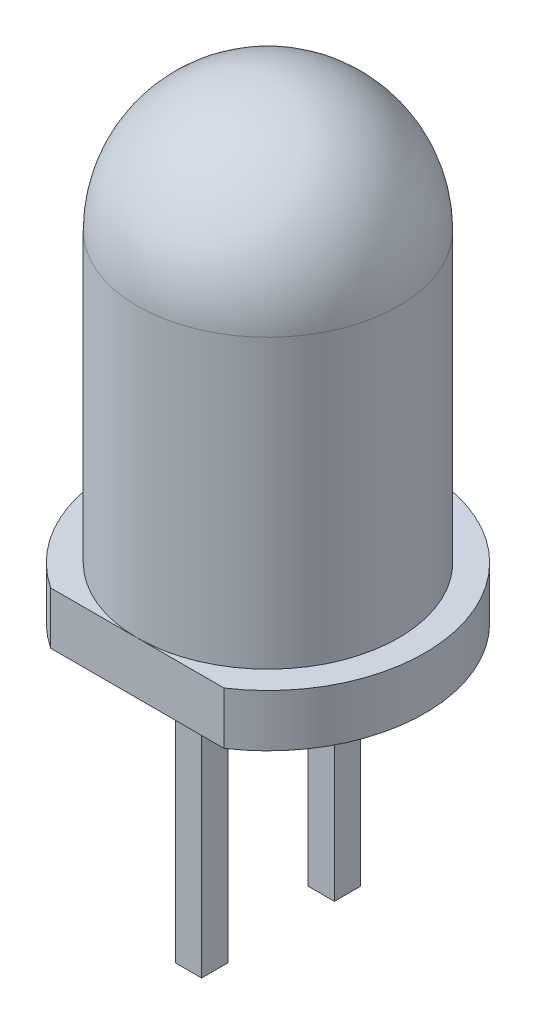
ISO-10303-21;
HEADER;
FILE_DESCRIPTION(('STEP AP214'),'2;1');
FILE_NAME('part.step','',(''),(''),'','','');
FILE_SCHEMA(('AUTOMOTIVE_DESIGN { 1 0 10303 214 1 1 1 1 }'));
ENDSEC;
DATA;
#1=APPLICATION_CONTEXT('core data for automotive mechanical design processes');
#2=APPLICATION_PROTOCOL_DEFINITION('international standard','automotive_design',2000,#1);
#3=PRODUCT_CONTEXT('',#1,'mechanical');
#4=PRODUCT('Part','Part','',(#3));
#5=PRODUCT_RELATED_PRODUCT_CATEGORY('part','',(#4));
#6=PRODUCT_DEFINITION_FORMATION('','',#4);
#7=PRODUCT_DEFINITION_CONTEXT('part definition',#1,'design');
#8=PRODUCT_DEFINITION('design','',#6,#7);
#9=PRODUCT_DEFINITION_SHAPE('','',#8);
#10=(LENGTH_UNIT() NAMED_UNIT(*) SI_UNIT(.MILLI.,.METRE.));
#11=(NAMED_UNIT(*) PLANE_ANGLE_UNIT() SI_UNIT($,.RADIAN.));
#12=(NAMED_UNIT(*) SI_UNIT($,.STERADIAN.) SOLID_ANGLE_UNIT());
#13=UNCERTAINTY_MEASURE_WITH_UNIT(LENGTH_MEASURE(1.E-05),#10,'distance_accuracy_value','');
#14=(GEOMETRIC_REPRESENTATION_CONTEXT(3) GLOBAL_UNCERTAINTY_ASSIGNED_CONTEXT((#13)) GLOBAL_UNIT_ASSIGNED_CONTEXT((#10,
#11,#12)) REPRESENTATION_CONTEXT('',''));
#15=CARTESIAN_POINT('',(0.,0.,0.));
#16=DIRECTION('',(0.,0.,1.));
#17=DIRECTION('',(1.,0.,0.));
#18=AXIS2_PLACEMENT_3D('',#15,#16,#17);
#19=CARTESIAN_POINT('',(0.,0.,0.));
#20=DIRECTION('',(0.,1.,0.));
#21=DIRECTION('',(1.,0.,0.));
#22=AXIS2_PLACEMENT_3D('',#19,#20,#21);
#23=CYLINDRICAL_SURFACE('',#22,2.5);
#24=CARTESIAN_POINT('',(0.,5.5,0.));
#25=DIRECTION('',(0.,1.,0.));
#26=DIRECTION('',(1.,0.,0.));
#27=AXIS2_PLACEMENT_3D('',#24,#25,#26);
#28=CIRCLE('',#27,2.5);
#29=CARTESIAN_POINT('',(-2.5,5.5,0.));
#30=VERTEX_POINT('',#29);
#31=CARTESIAN_POINT('',(0.,5.5,2.5));
#32=VERTEX_POINT('',#31);
#33=EDGE_CURVE('E179',#30,#32,#28,.T.);
#34=ORIENTED_EDGE('',*,*,#33,.F.);
#35=DIRECTION('',(0.,-1.,0.));
#36=VECTOR('',#35,1.);
#37=CARTESIAN_POINT('',(-2.5,0.,0.));
#38=LINE('',#37,#36);
#39=CARTESIAN_POINT('',(-2.5,0.,0.));
#40=VERTEX_POINT('',#39);
#41=EDGE_CURVE('E11',#30,#40,#38,.T.);
#42=ORIENTED_EDGE('',*,*,#41,.T.);
#43=CARTESIAN_POINT('',(0.,0.,0.));
#44=DIRECTION('',(0.,-1.,0.));
#45=DIRECTION('',(1.,0.,0.));
#46=AXIS2_PLACEMENT_3D('',#43,#44,#45);
#47=CIRCLE('',#46,2.5);
#48=CARTESIAN_POINT('',(0.,0.,2.5));
#49=VERTEX_POINT('',#48);
#50=EDGE_CURVE('E166',#49,#40,#47,.T.);
#51=ORIENTED_EDGE('',*,*,#50,.F.);
#52=CARTESIAN_POINT('',(0.,0.,0.));
#53=DIRECTION('',(0.,-1.,0.));
#54=DIRECTION('',(1.,0.,0.));
#55=AXIS2_PLACEMENT_3D('',#52,#53,#54);
#56=CIRCLE('',#55,2.5);
#57=EDGE_CURVE('E170',#40,#49,#56,.T.);
#58=ORIENTED_EDGE('',*,*,#57,.F.);
#59=ORIENTED_EDGE('',*,*,#41,.F.);
#60=CARTESIAN_POINT('',(0.,5.5,0.));
#61=DIRECTION('',(0.,1.,0.));
#62=DIRECTION('',(1.,0.,0.));
#63=AXIS2_PLACEMENT_3D('',#60,#61,#62);
#64=CIRCLE('',#63,2.5);
#65=EDGE_CURVE('E27',#32,#30,#64,.T.);
#66=ORIENTED_EDGE('',*,*,#65,.F.);
#67=EDGE_LOOP('',(#34,#42,#51,#58,#59,#66));
#68=FACE_BOUND('',#67,.T.);
#69=ADVANCED_FACE('F16',(#68),#23,.T.);
#70=CARTESIAN_POINT('',(0.,5.5,0.));
#71=DIRECTION('',(0.,1.,0.));
#72=DIRECTION('',(0.,0.,-1.));
#73=AXIS2_PLACEMENT_3D('',#70,#71,#72);
#74=SPHERICAL_SURFACE('',#73,2.5);
#75=ORIENTED_EDGE('',*,*,#33,.T.);
#76=CARTESIAN_POINT('',(0.,5.5,0.));
#77=DIRECTION('',(1.,0.,0.));
#78=DIRECTION('',(0.,0.,1.));
#79=AXIS2_PLACEMENT_3D('',#76,#77,#78);
#80=CIRCLE('',#79,2.5);
#81=CARTESIAN_POINT('',(0.,8.,0.));
#82=VERTEX_POINT('',#81);
#83=EDGE_CURVE('E40',#82,#32,#80,.T.);
#84=ORIENTED_EDGE('',*,*,#83,.F.);
#85=ORIENTED_EDGE('',*,*,#83,.T.);
#86=ORIENTED_EDGE('',*,*,#65,.T.);
#87=EDGE_LOOP('',(#75,#84,#85,#86));
#88=FACE_BOUND('',#87,.T.);
#89=ADVANCED_FACE('F315',(#88),#74,.T.);
#90=CARTESIAN_POINT('',(0.,-1.,0.0559551179846103));
#91=DIRECTION('',(0.,-1.,0.));
#92=DIRECTION('',(0.,0.,-1.));
#93=AXIS2_PLACEMENT_3D('',#90,#91,#92);
#94=PLANE('',#93);
#95=DIRECTION('',(0.,0.,1.));
#96=VECTOR('',#95,1.);
#97=CARTESIAN_POINT('',(-0.25,-1.,-0.482022441007695));
#98=LINE('',#97,#96);
#99=CARTESIAN_POINT('',(-0.25,-1.,-1.52));
#100=VERTEX_POINT('',#99);
#101=CARTESIAN_POINT('',(-0.25,-1.,-1.02));
#102=VERTEX_POINT('',#101);
#103=EDGE_CURVE('E154',#100,#102,#98,.T.);
#104=ORIENTED_EDGE('',*,*,#103,.T.);
#105=DIRECTION('',(1.,0.,0.));
#106=VECTOR('',#105,1.);
#107=CARTESIAN_POINT('',(0.125,-1.,-1.02));
#108=LINE('',#107,#106);
#109=CARTESIAN_POINT('',(0.25,-1.,-1.02));
#110=VERTEX_POINT('',#109);
#111=EDGE_CURVE('E213',#102,#110,#108,.T.);
#112=ORIENTED_EDGE('',*,*,#111,.T.);
#113=DIRECTION('',(0.,0.,-1.));
#114=VECTOR('',#113,1.);
#115=CARTESIAN_POINT('',(0.25,-1.,-0.732022441007695));
#116=LINE('',#115,#114);
#117=CARTESIAN_POINT('',(0.25,-1.,-1.52));
#118=VERTEX_POINT('',#117);
#119=EDGE_CURVE('E226',#110,#118,#116,.T.);
#120=ORIENTED_EDGE('',*,*,#119,.T.);
#121=DIRECTION('',(-1.,0.,0.));
#122=VECTOR('',#121,1.);
#123=CARTESIAN_POINT('',(-0.125,-1.,-1.52));
#124=LINE('',#123,#122);
#125=EDGE_CURVE('E139',#118,#100,#124,.T.);
#126=ORIENTED_EDGE('',*,*,#125,.T.);
#127=EDGE_LOOP('',(#104,#112,#120,#126));
#128=FACE_BOUND('',#127,.T.);
#129=DIRECTION('',(0.,0.,-1.));
#130=VECTOR('',#129,1.);
#131=CARTESIAN_POINT('',(0.25,-1.,0.537977558992305));
#132=LINE('',#131,#130);
#133=CARTESIAN_POINT('',(0.25,-1.,1.52));
#134=VERTEX_POINT('',#133);
#135=CARTESIAN_POINT('',(0.25,-1.,1.02));
#136=VERTEX_POINT('',#135);
#137=EDGE_CURVE('E243',#134,#136,#132,.T.);
#138=ORIENTED_EDGE('',*,*,#137,.T.);
#139=DIRECTION('',(-1.,0.,0.));
#140=VECTOR('',#139,1.);
#141=CARTESIAN_POINT('',(-0.125,-1.,1.02));
#142=LINE('',#141,#140);
#143=CARTESIAN_POINT('',(-0.25,-1.,1.02));
#144=VERTEX_POINT('',#143);
#145=EDGE_CURVE('E219',#136,#144,#142,.T.);
#146=ORIENTED_EDGE('',*,*,#145,.T.);
#147=DIRECTION('',(0.,0.,1.));
#148=VECTOR('',#147,1.);
#149=CARTESIAN_POINT('',(-0.25,-1.,0.787977558992305));
#150=LINE('',#149,#148);
#151=CARTESIAN_POINT('',(-0.25,-1.,1.52));
#152=VERTEX_POINT('',#151);
#153=EDGE_CURVE('E175',#144,#152,#150,.T.);
#154=ORIENTED_EDGE('',*,*,#153,.T.);
#155=DIRECTION('',(1.,0.,0.));
#156=VECTOR('',#155,1.);
#157=CARTESIAN_POINT('',(0.125,-1.,1.52));
#158=LINE('',#157,#156);
#159=EDGE_CURVE('E184',#152,#134,#158,.T.);
#160=ORIENTED_EDGE('',*,*,#159,.T.);
#161=EDGE_LOOP('',(#138,#146,#154,#160));
#162=FACE_BOUND('',#161,.T.);
#163=DIRECTION('',(-1.,0.,0.));
#164=VECTOR('',#163,1.);
#165=CARTESIAN_POINT('',(-1.6583123951777,-1.,2.5));
#166=LINE('',#165,#164);
#167=CARTESIAN_POINT('',(1.6583123951777,-1.,2.5));
#168=VERTEX_POINT('',#167);
#169=CARTESIAN_POINT('',(-1.6583123951777,-1.,2.5));
#170=VERTEX_POINT('',#169);
#171=EDGE_CURVE('E176',#168,#170,#166,.T.);
#172=ORIENTED_EDGE('',*,*,#171,.T.);
#173=CARTESIAN_POINT('',(0.,-1.,0.));
#174=DIRECTION('',(0.,-1.,0.));
#175=DIRECTION('',(0.552770798392567,0.,-0.833333333333333));
#176=AXIS2_PLACEMENT_3D('',#173,#174,#175);
#177=CIRCLE('',#176,3.);
#178=EDGE_CURVE('E188',#170,#168,#177,.T.);
#179=ORIENTED_EDGE('',*,*,#178,.T.);
#180=EDGE_LOOP('',(#172,#179));
#181=FACE_BOUND('',#180,.T.);
#182=ADVANCED_FACE('F18',(#128,#162,#181),#94,.T.);
#183=CARTESIAN_POINT('',(1.6583123951777,0.,2.5));
#184=DIRECTION('',(0.,0.,1.));
#185=DIRECTION('',(1.,0.,0.));
#186=AXIS2_PLACEMENT_3D('',#183,#184,#185);
#187=PLANE('',#186);
#188=DIRECTION('',(1.,0.,0.));
#189=VECTOR('',#188,1.);
#190=CARTESIAN_POINT('',(-1.6583123951777,0.,2.5));
#191=LINE('',#190,#189);
#192=CARTESIAN_POINT('',(-1.6583123951777,0.,2.5));
#193=VERTEX_POINT('',#192);
#194=EDGE_CURVE('E138',#193,#49,#191,.T.);
#195=ORIENTED_EDGE('',*,*,#194,.F.);
#196=DIRECTION('',(0.,-1.,0.));
#197=VECTOR('',#196,1.);
#198=CARTESIAN_POINT('',(-1.6583123951777,0.,2.5));
#199=LINE('',#198,#197);
#200=EDGE_CURVE('E180',#193,#170,#199,.T.);
#201=ORIENTED_EDGE('',*,*,#200,.T.);
#202=ORIENTED_EDGE('',*,*,#171,.F.);
#203=DIRECTION('',(0.,-1.,0.));
#204=VECTOR('',#203,1.);
#205=CARTESIAN_POINT('',(1.6583123951777,0.,2.5));
#206=LINE('',#205,#204);
#207=CARTESIAN_POINT('',(1.6583123951777,0.,2.5));
#208=VERTEX_POINT('',#207);
#209=EDGE_CURVE('E191',#208,#168,#206,.T.);
#210=ORIENTED_EDGE('',*,*,#209,.F.);
#211=DIRECTION('',(1.,0.,0.));
#212=VECTOR('',#211,1.);
#213=CARTESIAN_POINT('',(-1.6583123951777,0.,2.5));
#214=LINE('',#213,#212);
#215=EDGE_CURVE('E202',#49,#208,#214,.T.);
#216=ORIENTED_EDGE('',*,*,#215,.F.);
#217=EDGE_LOOP('',(#195,#201,#202,#210,#216));
#218=FACE_BOUND('',#217,.T.);
#219=ADVANCED_FACE('F309',(#218),#187,.T.);
#220=CARTESIAN_POINT('',(0.,0.,0.));
#221=DIRECTION('',(0.,-1.,0.));
#222=DIRECTION('',(0.552770798392567,0.,-0.833333333333333));
#223=AXIS2_PLACEMENT_3D('',#220,#221,#222);
#224=CYLINDRICAL_SURFACE('',#223,3.);
#225=CARTESIAN_POINT('',(0.,0.,0.));
#226=DIRECTION('',(0.,1.,0.));
#227=DIRECTION('',(0.552770798392567,0.,-0.833333333333333));
#228=AXIS2_PLACEMENT_3D('',#225,#226,#227);
#229=CIRCLE('',#228,3.);
#230=EDGE_CURVE('E194',#208,#193,#229,.T.);
#231=ORIENTED_EDGE('',*,*,#230,.F.);
#232=ORIENTED_EDGE('',*,*,#209,.T.);
#233=ORIENTED_EDGE('',*,*,#178,.F.);
#234=ORIENTED_EDGE('',*,*,#200,.F.);
#235=EDGE_LOOP('',(#231,#232,#233,#234));
#236=FACE_BOUND('',#235,.T.);
#237=ADVANCED_FACE('F487',(#236),#224,.T.);
#238=CARTESIAN_POINT('',(0.,0.,0.0559551179846103));
#239=DIRECTION('',(0.,-1.,0.));
#240=DIRECTION('',(0.,0.,-1.));
#241=AXIS2_PLACEMENT_3D('',#238,#239,#240);
#242=PLANE('',#241);
#243=ORIENTED_EDGE('',*,*,#194,.T.);
#244=ORIENTED_EDGE('',*,*,#50,.T.);
#245=ORIENTED_EDGE('',*,*,#57,.T.);
#246=ORIENTED_EDGE('',*,*,#215,.T.);
#247=ORIENTED_EDGE('',*,*,#230,.T.);
#248=EDGE_LOOP('',(#243,#244,#245,#246,#247));
#249=FACE_BOUND('',#248,.T.);
#250=ADVANCED_FACE('F306',(#249),#242,.F.);
#251=CARTESIAN_POINT('',(0.,-6.,-1.27));
#252=DIRECTION('',(0.,-1.,0.));
#253=DIRECTION('',(0.,0.,-1.));
#254=AXIS2_PLACEMENT_3D('',#251,#252,#253);
#255=PLANE('',#254);
#256=DIRECTION('',(1.,0.,0.));
#257=VECTOR('',#256,1.);
#258=CARTESIAN_POINT('',(-0.25,-6.,-1.52));
#259=LINE('',#258,#257);
#260=CARTESIAN_POINT('',(-0.25,-6.,-1.52));
#261=VERTEX_POINT('',#260);
#262=CARTESIAN_POINT('',(0.25,-6.,-1.52));
#263=VERTEX_POINT('',#262);
#264=EDGE_CURVE('E126',#261,#263,#259,.T.);
#265=ORIENTED_EDGE('',*,*,#264,.T.);
#266=DIRECTION('',(0.,0.,1.));
#267=VECTOR('',#266,1.);
#268=CARTESIAN_POINT('',(0.25,-6.,-1.52));
#269=LINE('',#268,#267);
#270=CARTESIAN_POINT('',(0.25,-6.,-1.02));
#271=VERTEX_POINT('',#270);
#272=EDGE_CURVE('E20',#263,#271,#269,.T.);
#273=ORIENTED_EDGE('',*,*,#272,.T.);
#274=DIRECTION('',(-1.,0.,0.));
#275=VECTOR('',#274,1.);
#276=CARTESIAN_POINT('',(0.25,-6.,-1.02));
#277=LINE('',#276,#275);
#278=CARTESIAN_POINT('',(-0.25,-6.,-1.02));
#279=VERTEX_POINT('',#278);
#280=EDGE_CURVE('E145',#271,#279,#277,.T.);
#281=ORIENTED_EDGE('',*,*,#280,.T.);
#282=DIRECTION('',(0.,0.,-1.));
#283=VECTOR('',#282,1.);
#284=CARTESIAN_POINT('',(-0.25,-6.,-1.02));
#285=LINE('',#284,#283);
#286=EDGE_CURVE('E142',#279,#261,#285,.T.);
#287=ORIENTED_EDGE('',*,*,#286,.T.);
#288=EDGE_LOOP('',(#265,#273,#281,#287));
#289=FACE_BOUND('',#288,.T.);
#290=ADVANCED_FACE('F143',(#289),#255,.T.);
#291=CARTESIAN_POINT('',(-0.25,-1.,-1.52));
#292=DIRECTION('',(0.,0.,-1.));
#293=DIRECTION('',(-1.,0.,0.));
#294=AXIS2_PLACEMENT_3D('',#291,#292,#293);
#295=PLANE('',#294);
#296=ORIENTED_EDGE('',*,*,#125,.F.);
#297=DIRECTION('',(0.,-1.,0.));
#298=VECTOR('',#297,1.);
#299=CARTESIAN_POINT('',(0.25,-1.,-1.52));
#300=LINE('',#299,#298);
#301=EDGE_CURVE('E133',#118,#263,#300,.T.);
#302=ORIENTED_EDGE('',*,*,#301,.T.);
#303=ORIENTED_EDGE('',*,*,#264,.F.);
#304=DIRECTION('',(0.,-1.,0.));
#305=VECTOR('',#304,1.);
#306=CARTESIAN_POINT('',(-0.25,-1.,-1.52));
#307=LINE('',#306,#305);
#308=EDGE_CURVE('E130',#100,#261,#307,.T.);
#309=ORIENTED_EDGE('',*,*,#308,.F.);
#310=EDGE_LOOP('',(#296,#302,#303,#309));
#311=FACE_BOUND('',#310,.T.);
#312=ADVANCED_FACE('F128',(#311),#295,.T.);
#313=CARTESIAN_POINT('',(0.25,-1.,-1.52));
#314=DIRECTION('',(1.,0.,0.));
#315=DIRECTION('',(0.,0.,-1.));
#316=AXIS2_PLACEMENT_3D('',#313,#314,#315);
#317=PLANE('',#316);
#318=ORIENTED_EDGE('',*,*,#119,.F.);
#319=DIRECTION('',(0.,-1.,0.));
#320=VECTOR('',#319,1.);
#321=CARTESIAN_POINT('',(0.25,-1.,-1.02));
#322=LINE('',#321,#320);
#323=EDGE_CURVE('E212',#110,#271,#322,.T.);
#324=ORIENTED_EDGE('',*,*,#323,.T.);
#325=ORIENTED_EDGE('',*,*,#272,.F.);
#326=ORIENTED_EDGE('',*,*,#301,.F.);
#327=EDGE_LOOP('',(#318,#324,#325,#326));
#328=FACE_BOUND('',#327,.T.);
#329=ADVANCED_FACE('F255',(#328),#317,.T.);
#330=CARTESIAN_POINT('',(0.25,-1.,-1.02));
#331=DIRECTION('',(0.,0.,1.));
#332=DIRECTION('',(1.,0.,0.));
#333=AXIS2_PLACEMENT_3D('',#330,#331,#332);
#334=PLANE('',#333);
#335=ORIENTED_EDGE('',*,*,#111,.F.);
#336=DIRECTION('',(0.,-1.,0.));
#337=VECTOR('',#336,1.);
#338=CARTESIAN_POINT('',(-0.25,-1.,-1.02));
#339=LINE('',#338,#337);
#340=EDGE_CURVE('E150',#102,#279,#339,.T.);
#341=ORIENTED_EDGE('',*,*,#340,.T.);
#342=ORIENTED_EDGE('',*,*,#280,.F.);
#343=ORIENTED_EDGE('',*,*,#323,.F.);
#344=EDGE_LOOP('',(#335,#341,#342,#343));
#345=FACE_BOUND('',#344,.T.);
#346=ADVANCED_FACE('F257',(#345),#334,.T.);
#347=CARTESIAN_POINT('',(-0.25,-1.,-1.02));
#348=DIRECTION('',(-1.,0.,0.));
#349=DIRECTION('',(0.,1.,0.));
#350=AXIS2_PLACEMENT_3D('',#347,#348,#349);
#351=PLANE('',#350);
#352=ORIENTED_EDGE('',*,*,#103,.F.);
#353=ORIENTED_EDGE('',*,*,#308,.T.);
#354=ORIENTED_EDGE('',*,*,#286,.F.);
#355=ORIENTED_EDGE('',*,*,#340,.F.);
#356=EDGE_LOOP('',(#352,#353,#354,#355));
#357=FACE_BOUND('',#356,.T.);
#358=ADVANCED_FACE('F152',(#357),#351,.T.);
#359=CARTESIAN_POINT('',(0.,-6.,1.27));
#360=DIRECTION('',(0.,-1.,0.));
#361=DIRECTION('',(0.,0.,-1.));
#362=AXIS2_PLACEMENT_3D('',#359,#360,#361);
#363=PLANE('',#362);
#364=DIRECTION('',(-1.,0.,0.));
#365=VECTOR('',#364,1.);
#366=CARTESIAN_POINT('',(-0.25,-6.,1.52));
#367=LINE('',#366,#365);
#368=CARTESIAN_POINT('',(0.25,-6.,1.52));
#369=VERTEX_POINT('',#368);
#370=CARTESIAN_POINT('',(-0.25,-6.,1.52));
#371=VERTEX_POINT('',#370);
#372=EDGE_CURVE('E160',#369,#371,#367,.T.);
#373=ORIENTED_EDGE('',*,*,#372,.T.);
#374=DIRECTION('',(0.,0.,-1.));
#375=VECTOR('',#374,1.);
#376=CARTESIAN_POINT('',(-0.25,-6.,1.02));
#377=LINE('',#376,#375);
#378=CARTESIAN_POINT('',(-0.25,-6.,1.02));
#379=VERTEX_POINT('',#378);
#380=EDGE_CURVE('E171',#371,#379,#377,.T.);
#381=ORIENTED_EDGE('',*,*,#380,.T.);
#382=DIRECTION('',(1.,0.,0.));
#383=VECTOR('',#382,1.);
#384=CARTESIAN_POINT('',(0.25,-6.,1.02));
#385=LINE('',#384,#383);
#386=CARTESIAN_POINT('',(0.25,-6.,1.02));
#387=VERTEX_POINT('',#386);
#388=EDGE_CURVE('E209',#379,#387,#385,.T.);
#389=ORIENTED_EDGE('',*,*,#388,.T.);
#390=DIRECTION('',(0.,0.,1.));
#391=VECTOR('',#390,1.);
#392=CARTESIAN_POINT('',(0.25,-6.,1.52));
#393=LINE('',#392,#391);
#394=EDGE_CURVE('E164',#387,#369,#393,.T.);
#395=ORIENTED_EDGE('',*,*,#394,.T.);
#396=EDGE_LOOP('',(#373,#381,#389,#395));
#397=FACE_BOUND('',#396,.T.);
#398=ADVANCED_FACE('F287',(#397),#363,.T.);
#399=CARTESIAN_POINT('',(0.25,-1.,1.52));
#400=DIRECTION('',(0.,0.,1.));
#401=DIRECTION('',(1.,0.,0.));
#402=AXIS2_PLACEMENT_3D('',#399,#400,#401);
#403=PLANE('',#402);
#404=ORIENTED_EDGE('',*,*,#159,.F.);
#405=DIRECTION('',(0.,-1.,0.));
#406=VECTOR('',#405,1.);
#407=CARTESIAN_POINT('',(-0.25,-1.,1.52));
#408=LINE('',#407,#406);
#409=EDGE_CURVE('E174',#152,#371,#408,.T.);
#410=ORIENTED_EDGE('',*,*,#409,.T.);
#411=ORIENTED_EDGE('',*,*,#372,.F.);
#412=DIRECTION('',(0.,-1.,0.));
#413=VECTOR('',#412,1.);
#414=CARTESIAN_POINT('',(0.25,-1.,1.52));
#415=LINE('',#414,#413);
#416=EDGE_CURVE('E240',#134,#369,#415,.T.);
#417=ORIENTED_EDGE('',*,*,#416,.F.);
#418=EDGE_LOOP('',(#404,#410,#411,#417));
#419=FACE_BOUND('',#418,.T.);
#420=ADVANCED_FACE('F290',(#419),#403,.T.);
#421=CARTESIAN_POINT('',(-0.25,-1.,1.52));
#422=DIRECTION('',(-1.,0.,0.));
#423=DIRECTION('',(0.,0.,1.));
#424=AXIS2_PLACEMENT_3D('',#421,#422,#423);
#425=PLANE('',#424);
#426=ORIENTED_EDGE('',*,*,#153,.F.);
#427=DIRECTION('',(0.,-1.,0.));
#428=VECTOR('',#427,1.);
#429=CARTESIAN_POINT('',(-0.25,-1.,1.02));
#430=LINE('',#429,#428);
#431=EDGE_CURVE('E205',#144,#379,#430,.T.);
#432=ORIENTED_EDGE('',*,*,#431,.T.);
#433=ORIENTED_EDGE('',*,*,#380,.F.);
#434=ORIENTED_EDGE('',*,*,#409,.F.);
#435=EDGE_LOOP('',(#426,#432,#433,#434));
#436=FACE_BOUND('',#435,.T.);
#437=ADVANCED_FACE('F277',(#436),#425,.T.);
#438=CARTESIAN_POINT('',(-0.25,-1.,1.02));
#439=DIRECTION('',(0.,0.,-1.));
#440=DIRECTION('',(0.,-1.,0.));
#441=AXIS2_PLACEMENT_3D('',#438,#439,#440);
#442=PLANE('',#441);
#443=ORIENTED_EDGE('',*,*,#145,.F.);
#444=DIRECTION('',(0.,-1.,0.));
#445=VECTOR('',#444,1.);
#446=CARTESIAN_POINT('',(0.25,-1.,1.02));
#447=LINE('',#446,#445);
#448=EDGE_CURVE('E234',#136,#387,#447,.T.);
#449=ORIENTED_EDGE('',*,*,#448,.T.);
#450=ORIENTED_EDGE('',*,*,#388,.F.);
#451=ORIENTED_EDGE('',*,*,#431,.F.);
#452=EDGE_LOOP('',(#443,#449,#450,#451));
#453=FACE_BOUND('',#452,.T.);
#454=ADVANCED_FACE('F281',(#453),#442,.T.);
#455=CARTESIAN_POINT('',(0.25,-1.,1.02));
#456=DIRECTION('',(1.,0.,0.));
#457=DIRECTION('',(0.,0.,1.));
#458=AXIS2_PLACEMENT_3D('',#455,#456,#457);
#459=PLANE('',#458);
#460=ORIENTED_EDGE('',*,*,#137,.F.);
#461=ORIENTED_EDGE('',*,*,#416,.T.);
#462=ORIENTED_EDGE('',*,*,#394,.F.);
#463=ORIENTED_EDGE('',*,*,#448,.F.);
#464=EDGE_LOOP('',(#460,#461,#462,#463));
#465=FACE_BOUND('',#464,.T.);
#466=ADVANCED_FACE('F294',(#465),#459,.T.);
#467=CLOSED_SHELL('',(#69,#89,#182,#219,#237,#250,#290,#312,#329,#346,#358,#398,#420,#437,#454,#466));
#468=MANIFOLD_SOLID_BREP('B1',#467);
#469=ADVANCED_BREP_SHAPE_REPRESENTATION('',(#18,#468),#14);
#470=SHAPE_DEFINITION_REPRESENTATION(#9,#469);
ENDSEC;
END-ISO-10303-21;
